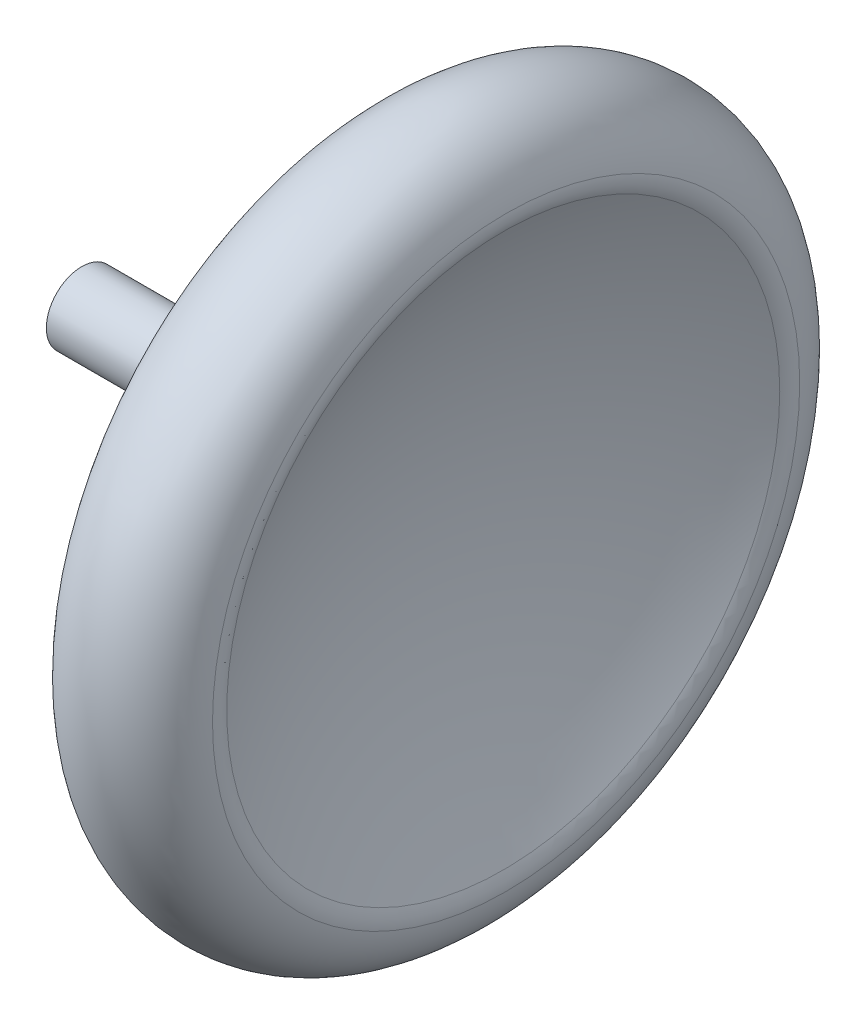
ISO-10303-21;
HEADER;
FILE_DESCRIPTION(('STEP AP214'),'2;1');
FILE_NAME('part.step','',(''),(''),'','','');
FILE_SCHEMA(('AUTOMOTIVE_DESIGN { 1 0 10303 214 1 1 1 1 }'));
ENDSEC;
DATA;
#1=APPLICATION_CONTEXT('core data for automotive mechanical design processes');
#2=APPLICATION_PROTOCOL_DEFINITION('international standard','automotive_design',2000,#1);
#3=PRODUCT_CONTEXT('',#1,'mechanical');
#4=PRODUCT('Part','Part','',(#3));
#5=PRODUCT_RELATED_PRODUCT_CATEGORY('part','',(#4));
#6=PRODUCT_DEFINITION_FORMATION('','',#4);
#7=PRODUCT_DEFINITION_CONTEXT('part definition',#1,'design');
#8=PRODUCT_DEFINITION('design','',#6,#7);
#9=PRODUCT_DEFINITION_SHAPE('','',#8);
#10=(LENGTH_UNIT() NAMED_UNIT(*) SI_UNIT(.MILLI.,.METRE.));
#11=(NAMED_UNIT(*) PLANE_ANGLE_UNIT() SI_UNIT($,.RADIAN.));
#12=(NAMED_UNIT(*) SI_UNIT($,.STERADIAN.) SOLID_ANGLE_UNIT());
#13=UNCERTAINTY_MEASURE_WITH_UNIT(LENGTH_MEASURE(1.E-05),#10,'distance_accuracy_value','');
#14=(GEOMETRIC_REPRESENTATION_CONTEXT(3) GLOBAL_UNCERTAINTY_ASSIGNED_CONTEXT((#13)) GLOBAL_UNIT_ASSIGNED_CONTEXT((#10,
#11,#12)) REPRESENTATION_CONTEXT('',''));
#15=CARTESIAN_POINT('',(0.,0.,0.));
#16=DIRECTION('',(0.,0.,1.));
#17=DIRECTION('',(1.,0.,0.));
#18=AXIS2_PLACEMENT_3D('',#15,#16,#17);
#19=CARTESIAN_POINT('',(-26.6072772108133,9.99999999999999,-122.500000000085));
#20=DIRECTION('',(1.,0.,0.));
#21=DIRECTION('',(0.,0.,-1.));
#22=AXIS2_PLACEMENT_3D('',#19,#20,#21);
#23=TOROIDAL_SURFACE('',#22,20.,5.);
#24=CARTESIAN_POINT('',(-21.6596776500125,9.99999999999999,-122.500000000085));
#25=DIRECTION('',(-1.,0.,0.));
#26=DIRECTION('',(0.,0.,1.));
#27=AXIS2_PLACEMENT_3D('',#24,#25,#26);
#28=CIRCLE('',#27,20.7219824000357);
#29=CARTESIAN_POINT('',(-21.6596776500125,9.99999999999999,-101.778017600049));
#30=VERTEX_POINT('',#29);
#31=EDGE_CURVE('E52',#30,#30,#28,.T.);
#32=ORIENTED_EDGE('',*,*,#31,.T.);
#33=EDGE_LOOP('',(#32));
#34=FACE_BOUND('',#33,.T.);
#35=CARTESIAN_POINT('',(-31.6072772108133,9.99999999999999,-122.500000000085));
#36=DIRECTION('',(1.,0.,0.));
#37=DIRECTION('',(0.,0.,-1.));
#38=AXIS2_PLACEMENT_3D('',#35,#36,#37);
#39=CIRCLE('',#38,20.);
#40=CARTESIAN_POINT('',(-31.6072772108133,9.99999999999999,-142.500000000085));
#41=VERTEX_POINT('',#40);
#42=EDGE_CURVE('E80',#41,#41,#39,.F.);
#43=ORIENTED_EDGE('',*,*,#42,.F.);
#44=EDGE_LOOP('',(#43));
#45=FACE_BOUND('',#44,.T.);
#46=ADVANCED_FACE('F35',(#34,#45),#23,.T.);
#47=CARTESIAN_POINT('',(-26.6072772108133,9.99999999999999,-122.500000000085));
#48=DIRECTION('',(-1.,0.,0.));
#49=DIRECTION('',(0.,0.,1.));
#50=AXIS2_PLACEMENT_3D('',#47,#48,#49);
#51=CYLINDRICAL_SURFACE('',#50,2.5);
#52=CARTESIAN_POINT('',(-33.6072772108133,9.99999999999999,-122.500000000085));
#53=DIRECTION('',(1.,0.,0.));
#54=DIRECTION('',(0.,0.,-1.));
#55=AXIS2_PLACEMENT_3D('',#52,#53,#54);
#56=CIRCLE('',#55,2.5);
#57=CARTESIAN_POINT('',(-33.6072772108133,9.99999999999999,-125.000000000085));
#58=VERTEX_POINT('',#57);
#59=EDGE_CURVE('E71',#58,#58,#56,.F.);
#60=ORIENTED_EDGE('',*,*,#59,.T.);
#61=EDGE_LOOP('',(#60));
#62=FACE_BOUND('',#61,.T.);
#63=CARTESIAN_POINT('',(-51.6072772108133,9.99999999999999,-122.500000000085));
#64=DIRECTION('',(1.,0.,0.));
#65=DIRECTION('',(0.,0.,-1.));
#66=AXIS2_PLACEMENT_3D('',#63,#64,#65);
#67=CIRCLE('',#66,2.5);
#68=CARTESIAN_POINT('',(-51.6072772108133,9.99999999999999,-125.000000000085));
#69=VERTEX_POINT('',#68);
#70=EDGE_CURVE('E83',#69,#69,#67,.T.);
#71=ORIENTED_EDGE('',*,*,#70,.T.);
#72=EDGE_LOOP('',(#71));
#73=FACE_BOUND('',#72,.T.);
#74=ADVANCED_FACE('F87',(#62,#73),#51,.T.);
#75=CARTESIAN_POINT('',(-51.6072772108133,9.99999999999999,-122.500000000085));
#76=DIRECTION('',(1.,0.,0.));
#77=DIRECTION('',(0.,0.,-1.));
#78=AXIS2_PLACEMENT_3D('',#75,#76,#77);
#79=PLANE('',#78);
#80=ORIENTED_EDGE('',*,*,#70,.F.);
#81=EDGE_LOOP('',(#80));
#82=FACE_BOUND('',#81,.T.);
#83=ADVANCED_FACE('F89',(#82),#79,.F.);
#84=CARTESIAN_POINT('',(15.8927227891867,9.99999999999999,-122.500000000085));
#85=DIRECTION('',(0.,0.,1.));
#86=DIRECTION('',(1.,0.,0.));
#87=AXIS2_PLACEMENT_3D('',#84,#85,#86);
#88=SPHERICAL_SURFACE('',#87,42.5);
#89=CARTESIAN_POINT('',(15.8927227891867,9.99999999999999,-122.500000000085));
#90=DIRECTION('',(1.,0.,0.));
#91=DIRECTION('',(0.,0.,-1.));
#92=AXIS2_PLACEMENT_3D('',#89,#90,#91);
#93=SPHERICAL_SURFACE('',#92,42.5);
#94=CARTESIAN_POINT('',(-21.8620235299048,9.99999999999999,-122.500000000085));
#95=DIRECTION('',(1.,0.,0.));
#96=DIRECTION('',(0.,0.,-1.));
#97=AXIS2_PLACEMENT_3D('',#94,#95,#96);
#98=CIRCLE('',#97,19.5148438472115);
#99=CARTESIAN_POINT('',(-21.8620235299048,9.99999999999999,-142.014843847297));
#100=VERTEX_POINT('',#99);
#101=EDGE_CURVE('E67',#100,#100,#98,.T.);
#102=ORIENTED_EDGE('',*,*,#101,.T.);
#103=EDGE_LOOP('',(#102));
#104=FACE_BOUND('',#103,.T.);
#105=ADVANCED_FACE('F91',(#104),#93,.F.);
#106=CARTESIAN_POINT('',(-31.6072772108133,9.99999999999999,-122.500000000085));
#107=DIRECTION('',(1.,0.,0.));
#108=DIRECTION('',(0.,0.,-1.));
#109=AXIS2_PLACEMENT_3D('',#106,#107,#108);
#110=PLANE('',#109);
#111=CARTESIAN_POINT('',(-31.6072772108133,9.99999999999999,-122.500000000085));
#112=DIRECTION('',(1.,0.,0.));
#113=DIRECTION('',(0.,0.,-1.));
#114=AXIS2_PLACEMENT_3D('',#111,#112,#113);
#115=CIRCLE('',#114,4.5);
#116=CARTESIAN_POINT('',(-31.6072772108133,9.99999999999999,-127.000000000085));
#117=VERTEX_POINT('',#116);
#118=EDGE_CURVE('E75',#117,#117,#115,.T.);
#119=ORIENTED_EDGE('',*,*,#118,.T.);
#120=EDGE_LOOP('',(#119));
#121=FACE_BOUND('',#120,.T.);
#122=ORIENTED_EDGE('',*,*,#42,.T.);
#123=EDGE_LOOP('',(#122));
#124=FACE_BOUND('',#123,.T.);
#125=ADVANCED_FACE('F97',(#121,#124),#110,.F.);
#126=CARTESIAN_POINT('',(-33.6072772108133,9.99999999999999,-122.500000000085));
#127=DIRECTION('',(1.,0.,0.));
#128=DIRECTION('',(0.,0.,-1.));
#129=AXIS2_PLACEMENT_3D('',#126,#127,#128);
#130=TOROIDAL_SURFACE('',#129,4.5,2.);
#131=ORIENTED_EDGE('',*,*,#59,.F.);
#132=EDGE_LOOP('',(#131));
#133=FACE_BOUND('',#132,.T.);
#134=ORIENTED_EDGE('',*,*,#118,.F.);
#135=EDGE_LOOP('',(#134));
#136=FACE_BOUND('',#135,.T.);
#137=ADVANCED_FACE('F111',(#133,#136),#130,.F.);
#138=CARTESIAN_POINT('',(-23.6387174743327,9.99999999999999,-122.500000000085));
#139=DIRECTION('',(1.,0.,0.));
#140=DIRECTION('',(0.,0.,-1.));
#141=AXIS2_PLACEMENT_3D('',#138,#139,#140);
#142=TOROIDAL_SURFACE('',#141,20.4331894400214,2.);
#143=ORIENTED_EDGE('',*,*,#31,.F.);
#144=EDGE_LOOP('',(#143));
#145=FACE_BOUND('',#144,.T.);
#146=ORIENTED_EDGE('',*,*,#101,.F.);
#147=EDGE_LOOP('',(#146));
#148=FACE_BOUND('',#147,.T.);
#149=ADVANCED_FACE('F113',(#145,#148),#142,.T.);
#150=CLOSED_SHELL('',(#46,#74,#83,#105,#125,#137,#149));
#151=CARTESIAN_POINT('',(-26.6072772108133,9.99999999999999,-122.500000000085));
#152=DIRECTION('',(1.,0.,0.));
#153=DIRECTION('',(0.,0.,-1.));
#154=AXIS2_PLACEMENT_3D('',#151,#152,#153);
#155=TOROIDAL_SURFACE('',#154,20.,4.);
#156=CARTESIAN_POINT('',(-22.6491975621725,9.99999999999999,-122.500000000085));
#157=DIRECTION('',(1.,0.,0.));
#158=DIRECTION('',(0.,0.,-1.));
#159=AXIS2_PLACEMENT_3D('',#156,#157,#158);
#160=CIRCLE('',#159,20.5775859200285);
#161=CARTESIAN_POINT('',(-22.6491975621725,9.99999999999999,-143.077585920114));
#162=VERTEX_POINT('',#161);
#163=EDGE_CURVE('E39',#162,#162,#160,.F.);
#164=ORIENTED_EDGE('',*,*,#163,.F.);
#165=EDGE_LOOP('',(#164));
#166=FACE_BOUND('',#165,.T.);
#167=CARTESIAN_POINT('',(-30.6072772108133,9.99999999999999,-122.500000000085));
#168=DIRECTION('',(1.,0.,0.));
#169=DIRECTION('',(0.,0.,-1.));
#170=AXIS2_PLACEMENT_3D('',#167,#168,#169);
#171=CIRCLE('',#170,20.);
#172=CARTESIAN_POINT('',(-30.6072772108133,9.99999999999999,-142.500000000085));
#173=VERTEX_POINT('',#172);
#174=EDGE_CURVE('E10',#173,#173,#171,.F.);
#175=ORIENTED_EDGE('',*,*,#174,.T.);
#176=EDGE_LOOP('',(#175));
#177=FACE_BOUND('',#176,.T.);
#178=ADVANCED_FACE('F119',(#166,#177),#155,.F.);
#179=CARTESIAN_POINT('',(-26.6072772108133,9.99999999999999,-122.500000000085));
#180=DIRECTION('',(-1.,0.,0.));
#181=DIRECTION('',(0.,0.,1.));
#182=AXIS2_PLACEMENT_3D('',#179,#180,#181);
#183=CYLINDRICAL_SURFACE('',#182,1.5);
#184=CARTESIAN_POINT('',(-33.6072772108133,9.99999999999999,-122.500000000085));
#185=DIRECTION('',(-1.,0.,0.));
#186=DIRECTION('',(0.,0.,1.));
#187=AXIS2_PLACEMENT_3D('',#184,#185,#186);
#188=CIRCLE('',#187,1.5);
#189=CARTESIAN_POINT('',(-33.6072772108133,9.99999999999999,-121.000000000085));
#190=VERTEX_POINT('',#189);
#191=EDGE_CURVE('E59',#190,#190,#188,.T.);
#192=ORIENTED_EDGE('',*,*,#191,.F.);
#193=EDGE_LOOP('',(#192));
#194=FACE_BOUND('',#193,.T.);
#195=CARTESIAN_POINT('',(-50.6072772108133,9.99999999999999,-122.500000000085));
#196=DIRECTION('',(1.,0.,0.));
#197=DIRECTION('',(0.,0.,-1.));
#198=AXIS2_PLACEMENT_3D('',#195,#196,#197);
#199=CIRCLE('',#198,1.5);
#200=CARTESIAN_POINT('',(-50.6072772108133,9.99999999999999,-124.000000000085));
#201=VERTEX_POINT('',#200);
#202=EDGE_CURVE('E57',#201,#201,#199,.T.);
#203=ORIENTED_EDGE('',*,*,#202,.F.);
#204=EDGE_LOOP('',(#203));
#205=FACE_BOUND('',#204,.T.);
#206=ADVANCED_FACE('F122',(#194,#205),#183,.F.);
#207=CARTESIAN_POINT('',(-50.6072772108133,9.99999999999999,-122.500000000085));
#208=DIRECTION('',(1.,0.,0.));
#209=DIRECTION('',(0.,0.,-1.));
#210=AXIS2_PLACEMENT_3D('',#207,#208,#209);
#211=PLANE('',#210);
#212=ORIENTED_EDGE('',*,*,#202,.T.);
#213=EDGE_LOOP('',(#212));
#214=FACE_BOUND('',#213,.T.);
#215=ADVANCED_FACE('F127',(#214),#211,.T.);
#216=CARTESIAN_POINT('',(15.8927227891867,9.99999999999999,-122.500000000085));
#217=DIRECTION('',(0.,0.,1.));
#218=DIRECTION('',(1.,0.,0.));
#219=AXIS2_PLACEMENT_3D('',#216,#217,#218);
#220=SPHERICAL_SURFACE('',#219,43.5);
#221=CARTESIAN_POINT('',(15.8927227891867,9.99999999999999,-122.500000000085));
#222=DIRECTION('',(1.,0.,0.));
#223=DIRECTION('',(0.,0.,-1.));
#224=AXIS2_PLACEMENT_3D('',#221,#222,#223);
#225=SPHERICAL_SURFACE('',#224,43.5);
#226=CARTESIAN_POINT('',(-22.7503705021188,9.99999999999999,-122.500000000085));
#227=DIRECTION('',(1.,0.,0.));
#228=DIRECTION('',(0.,0.,-1.));
#229=AXIS2_PLACEMENT_3D('',#226,#227,#228);
#230=CIRCLE('',#229,19.9740166436164);
#231=CARTESIAN_POINT('',(-22.7503705021188,9.99999999999999,-142.474016643702));
#232=VERTEX_POINT('',#231);
#233=EDGE_CURVE('E49',#232,#232,#230,.T.);
#234=ORIENTED_EDGE('',*,*,#233,.F.);
#235=EDGE_LOOP('',(#234));
#236=FACE_BOUND('',#235,.T.);
#237=ADVANCED_FACE('F131',(#236),#225,.T.);
#238=CARTESIAN_POINT('',(-30.6072772108133,9.99999999999999,-122.500000000085));
#239=DIRECTION('',(1.,0.,0.));
#240=DIRECTION('',(0.,0.,-1.));
#241=AXIS2_PLACEMENT_3D('',#238,#239,#240);
#242=PLANE('',#241);
#243=CARTESIAN_POINT('',(-30.6072772108133,9.99999999999999,-122.500000000085));
#244=DIRECTION('',(1.,0.,0.));
#245=DIRECTION('',(0.,0.,-1.));
#246=AXIS2_PLACEMENT_3D('',#243,#244,#245);
#247=CIRCLE('',#246,4.49999999999999);
#248=CARTESIAN_POINT('',(-30.6072772108133,9.99999999999999,-127.000000000085));
#249=VERTEX_POINT('',#248);
#250=EDGE_CURVE('E44',#249,#249,#247,.T.);
#251=ORIENTED_EDGE('',*,*,#250,.F.);
#252=EDGE_LOOP('',(#251));
#253=FACE_BOUND('',#252,.T.);
#254=ORIENTED_EDGE('',*,*,#174,.F.);
#255=EDGE_LOOP('',(#254));
#256=FACE_BOUND('',#255,.T.);
#257=ADVANCED_FACE('F135',(#253,#256),#242,.T.);
#258=CARTESIAN_POINT('',(-33.6072772108133,9.99999999999999,-122.500000000085));
#259=DIRECTION('',(1.,0.,0.));
#260=DIRECTION('',(0.,0.,-1.));
#261=AXIS2_PLACEMENT_3D('',#258,#259,#260);
#262=TOROIDAL_SURFACE('',#261,4.5,3.);
#263=ORIENTED_EDGE('',*,*,#191,.T.);
#264=EDGE_LOOP('',(#263));
#265=FACE_BOUND('',#264,.T.);
#266=ORIENTED_EDGE('',*,*,#250,.T.);
#267=EDGE_LOOP('',(#266));
#268=FACE_BOUND('',#267,.T.);
#269=ADVANCED_FACE('F138',(#265,#268),#262,.T.);
#270=CARTESIAN_POINT('',(-23.6387174743327,9.99999999999999,-122.500000000085));
#271=DIRECTION('',(1.,0.,0.));
#272=DIRECTION('',(0.,0.,-1.));
#273=AXIS2_PLACEMENT_3D('',#270,#271,#272);
#274=TOROIDAL_SURFACE('',#273,20.4331894400214,1.);
#275=ORIENTED_EDGE('',*,*,#163,.T.);
#276=EDGE_LOOP('',(#275));
#277=FACE_BOUND('',#276,.T.);
#278=ORIENTED_EDGE('',*,*,#233,.T.);
#279=EDGE_LOOP('',(#278));
#280=FACE_BOUND('',#279,.T.);
#281=ADVANCED_FACE('F37',(#277,#280),#274,.F.);
#282=CLOSED_SHELL('',(#178,#206,#215,#237,#257,#269,#281));
#283=ORIENTED_CLOSED_SHELL('',*,#282,.T.);
#284=BREP_WITH_VOIDS('B2',#150,(#283));
#285=ADVANCED_BREP_SHAPE_REPRESENTATION('',(#18,#284),#14);
#286=SHAPE_DEFINITION_REPRESENTATION(#9,#285);
ENDSEC;
END-ISO-10303-21;
